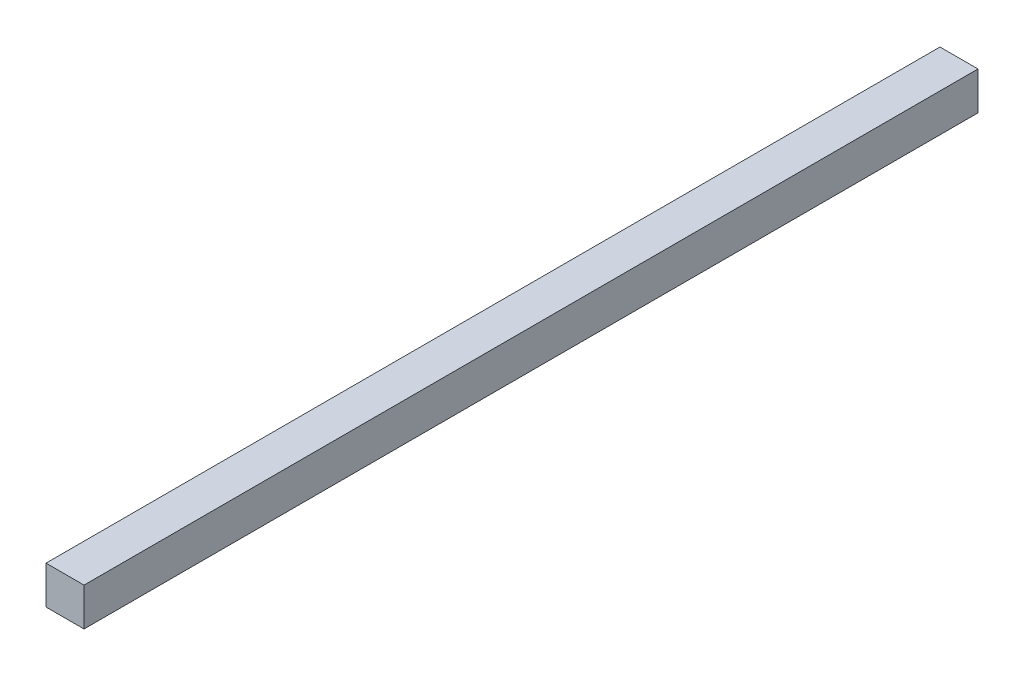
ISO-10303-21;
HEADER;
FILE_DESCRIPTION(('STEP AP214'),'2;1');
FILE_NAME('part.step','',(''),(''),'','','');
FILE_SCHEMA(('AUTOMOTIVE_DESIGN { 1 0 10303 214 1 1 1 1 }'));
ENDSEC;
DATA;
#1=APPLICATION_CONTEXT('core data for automotive mechanical design processes');
#2=APPLICATION_PROTOCOL_DEFINITION('international standard','automotive_design',2000,#1);
#3=PRODUCT_CONTEXT('',#1,'mechanical');
#4=PRODUCT('Part','Part','',(#3));
#5=PRODUCT_RELATED_PRODUCT_CATEGORY('part','',(#4));
#6=PRODUCT_DEFINITION_FORMATION('','',#4);
#7=PRODUCT_DEFINITION_CONTEXT('part definition',#1,'design');
#8=PRODUCT_DEFINITION('design','',#6,#7);
#9=PRODUCT_DEFINITION_SHAPE('','',#8);
#10=(LENGTH_UNIT() NAMED_UNIT(*) SI_UNIT(.MILLI.,.METRE.));
#11=(NAMED_UNIT(*) PLANE_ANGLE_UNIT() SI_UNIT($,.RADIAN.));
#12=(NAMED_UNIT(*) SI_UNIT($,.STERADIAN.) SOLID_ANGLE_UNIT());
#13=UNCERTAINTY_MEASURE_WITH_UNIT(LENGTH_MEASURE(1.E-05),#10,'distance_accuracy_value','');
#14=(GEOMETRIC_REPRESENTATION_CONTEXT(3) GLOBAL_UNCERTAINTY_ASSIGNED_CONTEXT((#13)) GLOBAL_UNIT_ASSIGNED_CONTEXT((#10,
#11,#12)) REPRESENTATION_CONTEXT('',''));
#15=CARTESIAN_POINT('',(0.,0.,0.));
#16=DIRECTION('',(0.,0.,1.));
#17=DIRECTION('',(1.,0.,0.));
#18=AXIS2_PLACEMENT_3D('',#15,#16,#17);
#19=CARTESIAN_POINT('',(-12.7,-12.7,596.9));
#20=DIRECTION('',(1.,0.,0.));
#21=DIRECTION('',(0.,0.,-1.));
#22=AXIS2_PLACEMENT_3D('',#19,#20,#21);
#23=PLANE('',#22);
#24=DIRECTION('',(0.,-1.,0.));
#25=VECTOR('',#24,1.);
#26=CARTESIAN_POINT('',(-12.7,-12.7,0.));
#27=LINE('',#26,#25);
#28=CARTESIAN_POINT('',(-12.7,12.7,0.));
#29=VERTEX_POINT('',#28);
#30=CARTESIAN_POINT('',(-12.7,-12.7,0.));
#31=VERTEX_POINT('',#30);
#32=EDGE_CURVE('E96',#29,#31,#27,.T.);
#33=ORIENTED_EDGE('',*,*,#32,.T.);
#34=DIRECTION('',(0.,0.,-1.));
#35=VECTOR('',#34,1.);
#36=CARTESIAN_POINT('',(-12.7,-12.7,596.9));
#37=LINE('',#36,#35);
#38=CARTESIAN_POINT('',(-12.7,-12.7,596.9));
#39=VERTEX_POINT('',#38);
#40=EDGE_CURVE('E11',#39,#31,#37,.T.);
#41=ORIENTED_EDGE('',*,*,#40,.F.);
#42=DIRECTION('',(0.,-1.,0.));
#43=VECTOR('',#42,1.);
#44=CARTESIAN_POINT('',(-12.7,-12.7,596.9));
#45=LINE('',#44,#43);
#46=CARTESIAN_POINT('',(-12.7,12.7,596.9));
#47=VERTEX_POINT('',#46);
#48=EDGE_CURVE('E84',#47,#39,#45,.T.);
#49=ORIENTED_EDGE('',*,*,#48,.F.);
#50=DIRECTION('',(0.,0.,-1.));
#51=VECTOR('',#50,1.);
#52=CARTESIAN_POINT('',(-12.7,12.7,596.9));
#53=LINE('',#52,#51);
#54=EDGE_CURVE('E92',#47,#29,#53,.T.);
#55=ORIENTED_EDGE('',*,*,#54,.T.);
#56=EDGE_LOOP('',(#33,#41,#49,#55));
#57=FACE_BOUND('',#56,.T.);
#58=ADVANCED_FACE('F33',(#57),#23,.F.);
#59=CARTESIAN_POINT('',(12.7,-12.7,596.9));
#60=DIRECTION('',(0.,1.,0.));
#61=DIRECTION('',(-1.,0.,0.));
#62=AXIS2_PLACEMENT_3D('',#59,#60,#61);
#63=PLANE('',#62);
#64=DIRECTION('',(1.,0.,0.));
#65=VECTOR('',#64,1.);
#66=CARTESIAN_POINT('',(12.7,-12.7,0.));
#67=LINE('',#66,#65);
#68=CARTESIAN_POINT('',(12.7,-12.7,0.));
#69=VERTEX_POINT('',#68);
#70=EDGE_CURVE('E88',#31,#69,#67,.T.);
#71=ORIENTED_EDGE('',*,*,#70,.T.);
#72=DIRECTION('',(0.,0.,-1.));
#73=VECTOR('',#72,1.);
#74=CARTESIAN_POINT('',(12.7,-12.7,596.9));
#75=LINE('',#74,#73);
#76=CARTESIAN_POINT('',(12.7,-12.7,596.9));
#77=VERTEX_POINT('',#76);
#78=EDGE_CURVE('E41',#77,#69,#75,.T.);
#79=ORIENTED_EDGE('',*,*,#78,.F.);
#80=DIRECTION('',(1.,0.,0.));
#81=VECTOR('',#80,1.);
#82=CARTESIAN_POINT('',(12.7,-12.7,596.9));
#83=LINE('',#82,#81);
#84=EDGE_CURVE('E79',#39,#77,#83,.T.);
#85=ORIENTED_EDGE('',*,*,#84,.F.);
#86=ORIENTED_EDGE('',*,*,#40,.T.);
#87=EDGE_LOOP('',(#71,#79,#85,#86));
#88=FACE_BOUND('',#87,.T.);
#89=ADVANCED_FACE('F87',(#88),#63,.F.);
#90=CARTESIAN_POINT('',(12.7,-12.7,596.9));
#91=DIRECTION('',(-1.,0.,0.));
#92=DIRECTION('',(0.,0.,1.));
#93=AXIS2_PLACEMENT_3D('',#90,#91,#92);
#94=PLANE('',#93);
#95=DIRECTION('',(0.,1.,0.));
#96=VECTOR('',#95,1.);
#97=CARTESIAN_POINT('',(12.7,-12.7,0.));
#98=LINE('',#97,#96);
#99=CARTESIAN_POINT('',(12.7,12.7,0.));
#100=VERTEX_POINT('',#99);
#101=EDGE_CURVE('E66',#69,#100,#98,.T.);
#102=ORIENTED_EDGE('',*,*,#101,.T.);
#103=DIRECTION('',(0.,0.,-1.));
#104=VECTOR('',#103,1.);
#105=CARTESIAN_POINT('',(12.7,12.7,596.9));
#106=LINE('',#105,#104);
#107=CARTESIAN_POINT('',(12.7,12.7,596.9));
#108=VERTEX_POINT('',#107);
#109=EDGE_CURVE('E89',#108,#100,#106,.T.);
#110=ORIENTED_EDGE('',*,*,#109,.F.);
#111=DIRECTION('',(0.,1.,0.));
#112=VECTOR('',#111,1.);
#113=CARTESIAN_POINT('',(12.7,-12.7,596.9));
#114=LINE('',#113,#112);
#115=EDGE_CURVE('E82',#77,#108,#114,.T.);
#116=ORIENTED_EDGE('',*,*,#115,.F.);
#117=ORIENTED_EDGE('',*,*,#78,.T.);
#118=EDGE_LOOP('',(#102,#110,#116,#117));
#119=FACE_BOUND('',#118,.T.);
#120=ADVANCED_FACE('F90',(#119),#94,.F.);
#121=CARTESIAN_POINT('',(12.7,12.7,596.9));
#122=DIRECTION('',(0.,-1.,0.));
#123=DIRECTION('',(1.,0.,0.));
#124=AXIS2_PLACEMENT_3D('',#121,#122,#123);
#125=PLANE('',#124);
#126=DIRECTION('',(-1.,0.,0.));
#127=VECTOR('',#126,1.);
#128=CARTESIAN_POINT('',(12.7,12.7,0.));
#129=LINE('',#128,#127);
#130=EDGE_CURVE('E72',#100,#29,#129,.T.);
#131=ORIENTED_EDGE('',*,*,#130,.T.);
#132=ORIENTED_EDGE('',*,*,#54,.F.);
#133=DIRECTION('',(-1.,0.,0.));
#134=VECTOR('',#133,1.);
#135=CARTESIAN_POINT('',(12.7,12.7,596.9));
#136=LINE('',#135,#134);
#137=EDGE_CURVE('E49',#108,#47,#136,.T.);
#138=ORIENTED_EDGE('',*,*,#137,.F.);
#139=ORIENTED_EDGE('',*,*,#109,.T.);
#140=EDGE_LOOP('',(#131,#132,#138,#139));
#141=FACE_BOUND('',#140,.T.);
#142=ADVANCED_FACE('F103',(#141),#125,.F.);
#143=CARTESIAN_POINT('',(0.,0.,596.9));
#144=DIRECTION('',(0.,0.,1.));
#145=DIRECTION('',(1.,0.,0.));
#146=AXIS2_PLACEMENT_3D('',#143,#144,#145);
#147=PLANE('',#146);
#148=ORIENTED_EDGE('',*,*,#48,.T.);
#149=ORIENTED_EDGE('',*,*,#84,.T.);
#150=ORIENTED_EDGE('',*,*,#115,.T.);
#151=ORIENTED_EDGE('',*,*,#137,.T.);
#152=EDGE_LOOP('',(#148,#149,#150,#151));
#153=FACE_BOUND('',#152,.T.);
#154=ADVANCED_FACE('F80',(#153),#147,.T.);
#155=CARTESIAN_POINT('',(0.,0.,0.));
#156=DIRECTION('',(0.,0.,1.));
#157=DIRECTION('',(1.,0.,0.));
#158=AXIS2_PLACEMENT_3D('',#155,#156,#157);
#159=PLANE('',#158);
#160=ORIENTED_EDGE('',*,*,#32,.F.);
#161=ORIENTED_EDGE('',*,*,#130,.F.);
#162=ORIENTED_EDGE('',*,*,#101,.F.);
#163=ORIENTED_EDGE('',*,*,#70,.F.);
#164=EDGE_LOOP('',(#160,#161,#162,#163));
#165=FACE_BOUND('',#164,.T.);
#166=ADVANCED_FACE('F106',(#165),#159,.F.);
#167=CLOSED_SHELL('',(#58,#89,#120,#142,#154,#166));
#168=MANIFOLD_SOLID_BREP('B2',#167);
#169=ADVANCED_BREP_SHAPE_REPRESENTATION('',(#18,#168),#14);
#170=SHAPE_DEFINITION_REPRESENTATION(#9,#169);
ENDSEC;
END-ISO-10303-21;
